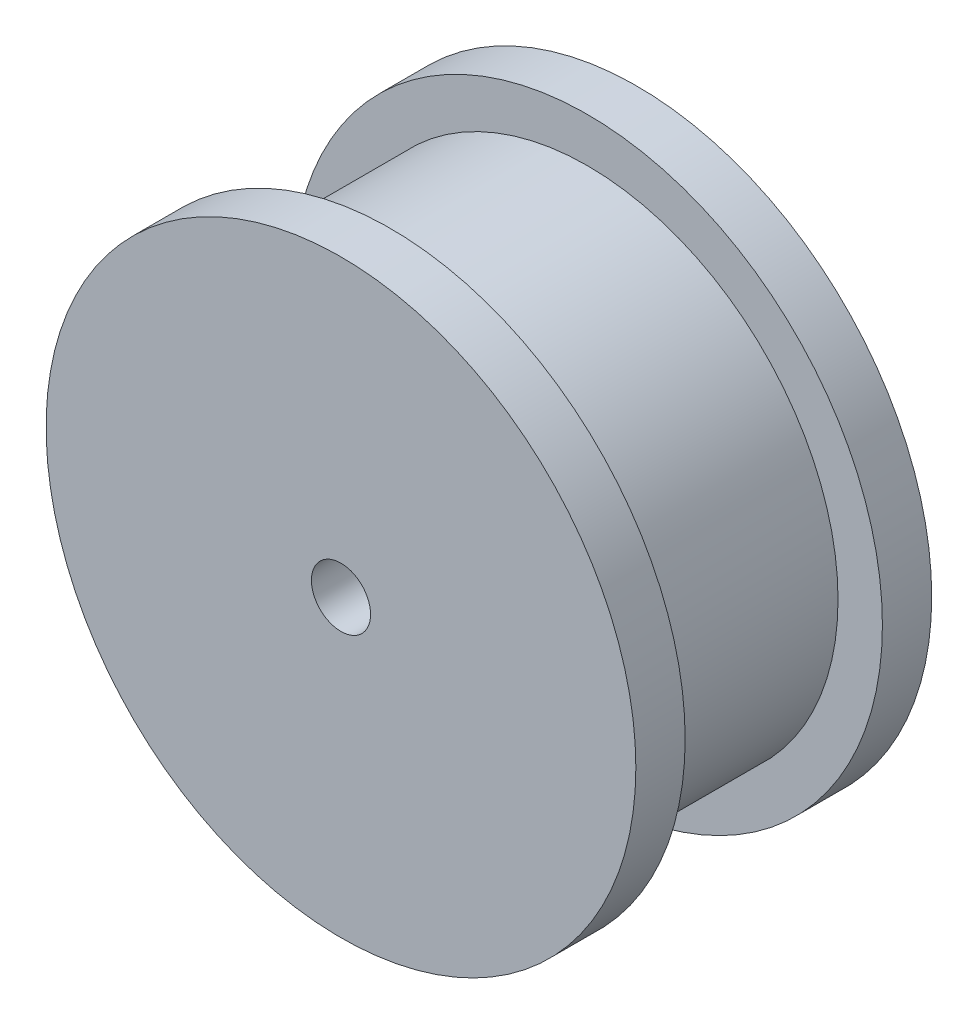
ISO-10303-21;
HEADER;
FILE_DESCRIPTION(('STEP AP214'),'2;1');
FILE_NAME('part.step','',(''),(''),'','','');
FILE_SCHEMA(('AUTOMOTIVE_DESIGN { 1 0 10303 214 1 1 1 1 }'));
ENDSEC;
DATA;
#1=APPLICATION_CONTEXT('core data for automotive mechanical design processes');
#2=APPLICATION_PROTOCOL_DEFINITION('international standard','automotive_design',2000,#1);
#3=PRODUCT_CONTEXT('',#1,'mechanical');
#4=PRODUCT('Part','Part','',(#3));
#5=PRODUCT_RELATED_PRODUCT_CATEGORY('part','',(#4));
#6=PRODUCT_DEFINITION_FORMATION('','',#4);
#7=PRODUCT_DEFINITION_CONTEXT('part definition',#1,'design');
#8=PRODUCT_DEFINITION('design','',#6,#7);
#9=PRODUCT_DEFINITION_SHAPE('','',#8);
#10=(LENGTH_UNIT() NAMED_UNIT(*) SI_UNIT(.MILLI.,.METRE.));
#11=(NAMED_UNIT(*) PLANE_ANGLE_UNIT() SI_UNIT($,.RADIAN.));
#12=(NAMED_UNIT(*) SI_UNIT($,.STERADIAN.) SOLID_ANGLE_UNIT());
#13=UNCERTAINTY_MEASURE_WITH_UNIT(LENGTH_MEASURE(1.E-05),#10,'distance_accuracy_value','');
#14=(GEOMETRIC_REPRESENTATION_CONTEXT(3) GLOBAL_UNCERTAINTY_ASSIGNED_CONTEXT((#13)) GLOBAL_UNIT_ASSIGNED_CONTEXT((#10,
#11,#12)) REPRESENTATION_CONTEXT('',''));
#15=CARTESIAN_POINT('',(0.,0.,0.));
#16=DIRECTION('',(0.,0.,1.));
#17=DIRECTION('',(1.,0.,0.));
#18=AXIS2_PLACEMENT_3D('',#15,#16,#17);
#19=CARTESIAN_POINT('',(0.,0.,10.));
#20=DIRECTION('',(0.,0.,-1.));
#21=DIRECTION('',(-1.,0.,0.));
#22=AXIS2_PLACEMENT_3D('',#19,#20,#21);
#23=CYLINDRICAL_SURFACE('',#22,25.4);
#24=CARTESIAN_POINT('',(0.,0.,10.));
#25=DIRECTION('',(0.,0.,1.));
#26=DIRECTION('',(1.,0.,0.));
#27=AXIS2_PLACEMENT_3D('',#24,#25,#26);
#28=CIRCLE('',#27,25.4);
#29=CARTESIAN_POINT('',(25.4,0.,10.));
#30=VERTEX_POINT('',#29);
#31=EDGE_CURVE('E10',#30,#30,#28,.T.);
#32=ORIENTED_EDGE('',*,*,#31,.F.);
#33=EDGE_LOOP('',(#32));
#34=FACE_BOUND('',#33,.T.);
#35=CARTESIAN_POINT('',(0.,0.,-10.));
#36=DIRECTION('',(0.,0.,-1.));
#37=DIRECTION('',(-1.,0.,0.));
#38=AXIS2_PLACEMENT_3D('',#35,#36,#37);
#39=CIRCLE('',#38,25.4);
#40=CARTESIAN_POINT('',(-25.4,0.,-10.));
#41=VERTEX_POINT('',#40);
#42=EDGE_CURVE('E45',#41,#41,#39,.T.);
#43=ORIENTED_EDGE('',*,*,#42,.F.);
#44=EDGE_LOOP('',(#43));
#45=FACE_BOUND('',#44,.T.);
#46=ADVANCED_FACE('F30',(#34,#45),#23,.T.);
#47=CARTESIAN_POINT('',(0.,0.,15.));
#48=DIRECTION('',(0.,0.,-1.));
#49=DIRECTION('',(-1.,0.,0.));
#50=AXIS2_PLACEMENT_3D('',#47,#48,#49);
#51=CYLINDRICAL_SURFACE('',#50,29.9);
#52=CARTESIAN_POINT('',(0.,0.,15.));
#53=DIRECTION('',(0.,0.,1.));
#54=DIRECTION('',(1.,0.,0.));
#55=AXIS2_PLACEMENT_3D('',#52,#53,#54);
#56=CIRCLE('',#55,29.9);
#57=CARTESIAN_POINT('',(29.9,0.,15.));
#58=VERTEX_POINT('',#57);
#59=EDGE_CURVE('E37',#58,#58,#56,.T.);
#60=ORIENTED_EDGE('',*,*,#59,.F.);
#61=EDGE_LOOP('',(#60));
#62=FACE_BOUND('',#61,.T.);
#63=CARTESIAN_POINT('',(0.,0.,10.));
#64=DIRECTION('',(0.,0.,1.));
#65=DIRECTION('',(1.,0.,0.));
#66=AXIS2_PLACEMENT_3D('',#63,#64,#65);
#67=CIRCLE('',#66,29.9);
#68=CARTESIAN_POINT('',(29.9,0.,10.));
#69=VERTEX_POINT('',#68);
#70=EDGE_CURVE('E41',#69,#69,#67,.T.);
#71=ORIENTED_EDGE('',*,*,#70,.T.);
#72=EDGE_LOOP('',(#71));
#73=FACE_BOUND('',#72,.T.);
#74=ADVANCED_FACE('F86',(#62,#73),#51,.T.);
#75=CARTESIAN_POINT('',(0.,0.,15.));
#76=DIRECTION('',(0.,0.,1.));
#77=DIRECTION('',(1.,0.,0.));
#78=AXIS2_PLACEMENT_3D('',#75,#76,#77);
#79=PLANE('',#78);
#80=CARTESIAN_POINT('',(0.,0.,15.));
#81=DIRECTION('',(0.,0.,1.));
#82=DIRECTION('',(1.,0.,0.));
#83=AXIS2_PLACEMENT_3D('',#80,#81,#82);
#84=CIRCLE('',#83,3.);
#85=CARTESIAN_POINT('',(3.,0.,15.));
#86=VERTEX_POINT('',#85);
#87=EDGE_CURVE('E55',#86,#86,#84,.T.);
#88=ORIENTED_EDGE('',*,*,#87,.F.);
#89=EDGE_LOOP('',(#88));
#90=FACE_BOUND('',#89,.T.);
#91=ORIENTED_EDGE('',*,*,#59,.T.);
#92=EDGE_LOOP('',(#91));
#93=FACE_BOUND('',#92,.T.);
#94=ADVANCED_FACE('F91',(#90,#93),#79,.T.);
#95=CARTESIAN_POINT('',(0.,0.,10.));
#96=DIRECTION('',(0.,0.,1.));
#97=DIRECTION('',(1.,0.,0.));
#98=AXIS2_PLACEMENT_3D('',#95,#96,#97);
#99=PLANE('',#98);
#100=ORIENTED_EDGE('',*,*,#31,.T.);
#101=EDGE_LOOP('',(#100));
#102=FACE_BOUND('',#101,.T.);
#103=ORIENTED_EDGE('',*,*,#70,.F.);
#104=EDGE_LOOP('',(#103));
#105=FACE_BOUND('',#104,.T.);
#106=ADVANCED_FACE('F74',(#102,#105),#99,.F.);
#107=CARTESIAN_POINT('',(0.,0.,-15.));
#108=DIRECTION('',(0.,0.,1.));
#109=DIRECTION('',(1.,0.,0.));
#110=AXIS2_PLACEMENT_3D('',#107,#108,#109);
#111=CYLINDRICAL_SURFACE('',#110,29.9);
#112=CARTESIAN_POINT('',(0.,0.,-15.));
#113=DIRECTION('',(0.,0.,1.));
#114=DIRECTION('',(1.,0.,0.));
#115=AXIS2_PLACEMENT_3D('',#112,#113,#114);
#116=CIRCLE('',#115,29.9);
#117=CARTESIAN_POINT('',(29.9,0.,-15.));
#118=VERTEX_POINT('',#117);
#119=EDGE_CURVE('E49',#118,#118,#116,.T.);
#120=ORIENTED_EDGE('',*,*,#119,.T.);
#121=EDGE_LOOP('',(#120));
#122=FACE_BOUND('',#121,.T.);
#123=CARTESIAN_POINT('',(0.,0.,-10.));
#124=DIRECTION('',(0.,0.,1.));
#125=DIRECTION('',(1.,0.,0.));
#126=AXIS2_PLACEMENT_3D('',#123,#124,#125);
#127=CIRCLE('',#126,29.9);
#128=CARTESIAN_POINT('',(29.9,0.,-10.));
#129=VERTEX_POINT('',#128);
#130=EDGE_CURVE('E50',#129,#129,#127,.T.);
#131=ORIENTED_EDGE('',*,*,#130,.F.);
#132=EDGE_LOOP('',(#131));
#133=FACE_BOUND('',#132,.T.);
#134=ADVANCED_FACE('F68',(#122,#133),#111,.T.);
#135=CARTESIAN_POINT('',(0.,0.,-15.));
#136=DIRECTION('',(0.,0.,-1.));
#137=DIRECTION('',(1.,0.,0.));
#138=AXIS2_PLACEMENT_3D('',#135,#136,#137);
#139=PLANE('',#138);
#140=CARTESIAN_POINT('',(0.,0.,-15.));
#141=DIRECTION('',(0.,0.,-1.));
#142=DIRECTION('',(-1.,0.,0.));
#143=AXIS2_PLACEMENT_3D('',#140,#141,#142);
#144=CIRCLE('',#143,3.);
#145=CARTESIAN_POINT('',(-3.,0.,-15.));
#146=VERTEX_POINT('',#145);
#147=EDGE_CURVE('E33',#146,#146,#144,.T.);
#148=ORIENTED_EDGE('',*,*,#147,.F.);
#149=EDGE_LOOP('',(#148));
#150=FACE_BOUND('',#149,.T.);
#151=ORIENTED_EDGE('',*,*,#119,.F.);
#152=EDGE_LOOP('',(#151));
#153=FACE_BOUND('',#152,.T.);
#154=ADVANCED_FACE('F64',(#150,#153),#139,.T.);
#155=CARTESIAN_POINT('',(0.,0.,-10.));
#156=DIRECTION('',(0.,0.,-1.));
#157=DIRECTION('',(1.,0.,0.));
#158=AXIS2_PLACEMENT_3D('',#155,#156,#157);
#159=PLANE('',#158);
#160=ORIENTED_EDGE('',*,*,#42,.T.);
#161=EDGE_LOOP('',(#160));
#162=FACE_BOUND('',#161,.T.);
#163=ORIENTED_EDGE('',*,*,#130,.T.);
#164=EDGE_LOOP('',(#163));
#165=FACE_BOUND('',#164,.T.);
#166=ADVANCED_FACE('F67',(#162,#165),#159,.F.);
#167=CARTESIAN_POINT('',(0.,0.,-61.628));
#168=DIRECTION('',(0.,0.,1.));
#169=DIRECTION('',(1.,0.,0.));
#170=AXIS2_PLACEMENT_3D('',#167,#168,#169);
#171=CYLINDRICAL_SURFACE('',#170,3.);
#172=ORIENTED_EDGE('',*,*,#147,.T.);
#173=EDGE_LOOP('',(#172));
#174=FACE_BOUND('',#173,.T.);
#175=ORIENTED_EDGE('',*,*,#87,.T.);
#176=EDGE_LOOP('',(#175));
#177=FACE_BOUND('',#176,.T.);
#178=ADVANCED_FACE('F62',(#174,#177),#171,.F.);
#179=CLOSED_SHELL('',(#46,#74,#94,#106,#134,#154,#166,#178));
#180=MANIFOLD_SOLID_BREP('B2',#179);
#181=ADVANCED_BREP_SHAPE_REPRESENTATION('',(#18,#180),#14);
#182=SHAPE_DEFINITION_REPRESENTATION(#9,#181);
ENDSEC;
END-ISO-10303-21;
